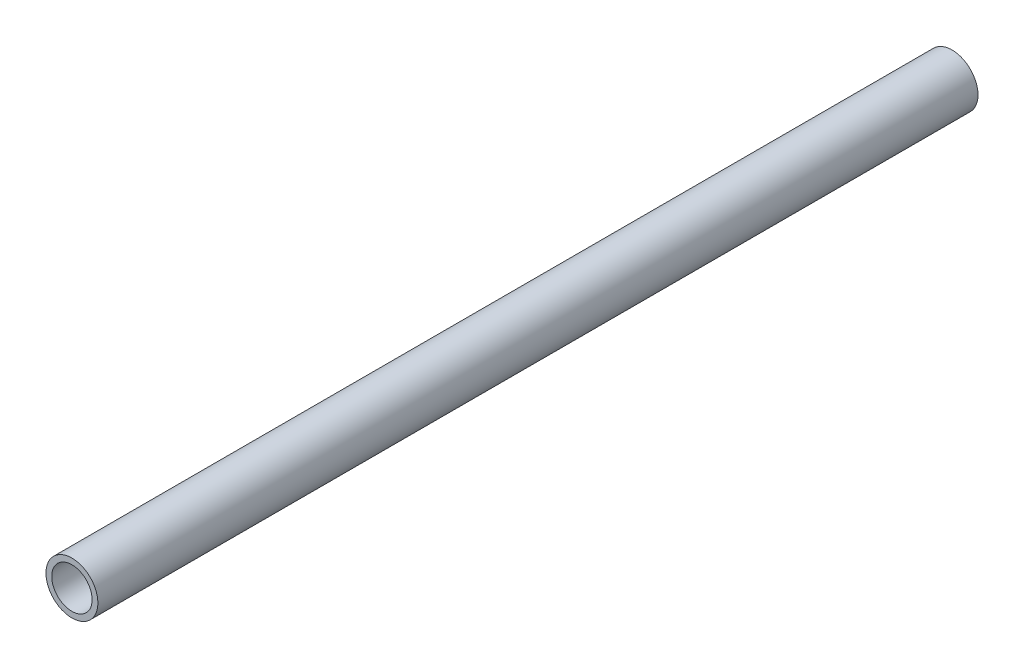
ISO-10303-21;
HEADER;
FILE_DESCRIPTION(('STEP AP214'),'2;1');
FILE_NAME('part.step','',(''),(''),'','','');
FILE_SCHEMA(('AUTOMOTIVE_DESIGN { 1 0 10303 214 1 1 1 1 }'));
ENDSEC;
DATA;
#1=APPLICATION_CONTEXT('core data for automotive mechanical design processes');
#2=APPLICATION_PROTOCOL_DEFINITION('international standard','automotive_design',2000,#1);
#3=PRODUCT_CONTEXT('',#1,'mechanical');
#4=PRODUCT('Part','Part','',(#3));
#5=PRODUCT_RELATED_PRODUCT_CATEGORY('part','',(#4));
#6=PRODUCT_DEFINITION_FORMATION('','',#4);
#7=PRODUCT_DEFINITION_CONTEXT('part definition',#1,'design');
#8=PRODUCT_DEFINITION('design','',#6,#7);
#9=PRODUCT_DEFINITION_SHAPE('','',#8);
#10=(LENGTH_UNIT() NAMED_UNIT(*) SI_UNIT(.MILLI.,.METRE.));
#11=(NAMED_UNIT(*) PLANE_ANGLE_UNIT() SI_UNIT($,.RADIAN.));
#12=(NAMED_UNIT(*) SI_UNIT($,.STERADIAN.) SOLID_ANGLE_UNIT());
#13=UNCERTAINTY_MEASURE_WITH_UNIT(LENGTH_MEASURE(1.E-05),#10,'distance_accuracy_value','');
#14=(GEOMETRIC_REPRESENTATION_CONTEXT(3) GLOBAL_UNCERTAINTY_ASSIGNED_CONTEXT((#13)) GLOBAL_UNIT_ASSIGNED_CONTEXT((#10,
#11,#12)) REPRESENTATION_CONTEXT('',''));
#15=CARTESIAN_POINT('',(0.,0.,0.));
#16=DIRECTION('',(0.,0.,1.));
#17=DIRECTION('',(1.,0.,0.));
#18=AXIS2_PLACEMENT_3D('',#15,#16,#17);
#19=CARTESIAN_POINT('',(0.,0.,305.));
#20=DIRECTION('',(0.,0.,-1.));
#21=DIRECTION('',(-1.,0.,0.));
#22=AXIS2_PLACEMENT_3D('',#19,#20,#21);
#23=CYLINDRICAL_SURFACE('',#22,9.);
#24=CARTESIAN_POINT('',(0.,0.,305.));
#25=DIRECTION('',(0.,0.,1.));
#26=DIRECTION('',(1.,0.,0.));
#27=AXIS2_PLACEMENT_3D('',#24,#25,#26);
#28=CIRCLE('',#27,9.);
#29=CARTESIAN_POINT('',(9.,0.,305.));
#30=VERTEX_POINT('',#29);
#31=EDGE_CURVE('E10',#30,#30,#28,.T.);
#32=ORIENTED_EDGE('',*,*,#31,.F.);
#33=EDGE_LOOP('',(#32));
#34=FACE_BOUND('',#33,.T.);
#35=CARTESIAN_POINT('',(0.,0.,0.));
#36=DIRECTION('',(0.,0.,1.));
#37=DIRECTION('',(1.,0.,0.));
#38=AXIS2_PLACEMENT_3D('',#35,#36,#37);
#39=CIRCLE('',#38,9.);
#40=CARTESIAN_POINT('',(9.,0.,0.));
#41=VERTEX_POINT('',#40);
#42=EDGE_CURVE('E41',#41,#41,#39,.T.);
#43=ORIENTED_EDGE('',*,*,#42,.T.);
#44=EDGE_LOOP('',(#43));
#45=FACE_BOUND('',#44,.T.);
#46=ADVANCED_FACE('F35',(#34,#45),#23,.T.);
#47=CARTESIAN_POINT('',(0.,0.,305.));
#48=DIRECTION('',(0.,0.,1.));
#49=DIRECTION('',(1.,0.,0.));
#50=AXIS2_PLACEMENT_3D('',#47,#48,#49);
#51=PLANE('',#50);
#52=CARTESIAN_POINT('',(0.,0.,305.));
#53=DIRECTION('',(0.,0.,1.));
#54=DIRECTION('',(1.,0.,0.));
#55=AXIS2_PLACEMENT_3D('',#52,#53,#54);
#56=CIRCLE('',#55,6.99999999999999);
#57=CARTESIAN_POINT('',(6.99999999999999,0.,305.));
#58=VERTEX_POINT('',#57);
#59=EDGE_CURVE('E45',#58,#58,#56,.T.);
#60=ORIENTED_EDGE('',*,*,#59,.F.);
#61=EDGE_LOOP('',(#60));
#62=FACE_BOUND('',#61,.T.);
#63=ORIENTED_EDGE('',*,*,#31,.T.);
#64=EDGE_LOOP('',(#63));
#65=FACE_BOUND('',#64,.T.);
#66=ADVANCED_FACE('F64',(#62,#65),#51,.T.);
#67=CARTESIAN_POINT('',(0.,0.,0.));
#68=DIRECTION('',(0.,0.,1.));
#69=DIRECTION('',(1.,0.,0.));
#70=AXIS2_PLACEMENT_3D('',#67,#68,#69);
#71=PLANE('',#70);
#72=CARTESIAN_POINT('',(0.,0.,0.));
#73=DIRECTION('',(0.,0.,1.));
#74=DIRECTION('',(1.,0.,0.));
#75=AXIS2_PLACEMENT_3D('',#72,#73,#74);
#76=CIRCLE('',#75,6.99999999999993);
#77=CARTESIAN_POINT('',(6.99999999999993,0.,0.));
#78=VERTEX_POINT('',#77);
#79=EDGE_CURVE('E49',#78,#78,#76,.T.);
#80=ORIENTED_EDGE('',*,*,#79,.T.);
#81=EDGE_LOOP('',(#80));
#82=FACE_BOUND('',#81,.T.);
#83=ORIENTED_EDGE('',*,*,#42,.F.);
#84=EDGE_LOOP('',(#83));
#85=FACE_BOUND('',#84,.T.);
#86=ADVANCED_FACE('F55',(#82,#85),#71,.F.);
#87=CARTESIAN_POINT('',(0.,0.,305.));
#88=DIRECTION('',(0.,0.,1.));
#89=DIRECTION('',(1.,0.,0.));
#90=AXIS2_PLACEMENT_3D('',#87,#88,#89);
#91=CYLINDRICAL_SURFACE('',#90,6.99999999999996);
#92=ORIENTED_EDGE('',*,*,#79,.F.);
#93=EDGE_LOOP('',(#92));
#94=FACE_BOUND('',#93,.T.);
#95=ORIENTED_EDGE('',*,*,#59,.T.);
#96=EDGE_LOOP('',(#95));
#97=FACE_BOUND('',#96,.T.);
#98=ADVANCED_FACE('F58',(#94,#97),#91,.F.);
#99=CLOSED_SHELL('',(#46,#66,#86,#98));
#100=MANIFOLD_SOLID_BREP('B2',#99);
#101=ADVANCED_BREP_SHAPE_REPRESENTATION('',(#18,#100),#14);
#102=SHAPE_DEFINITION_REPRESENTATION(#9,#101);
ENDSEC;
END-ISO-10303-21;
